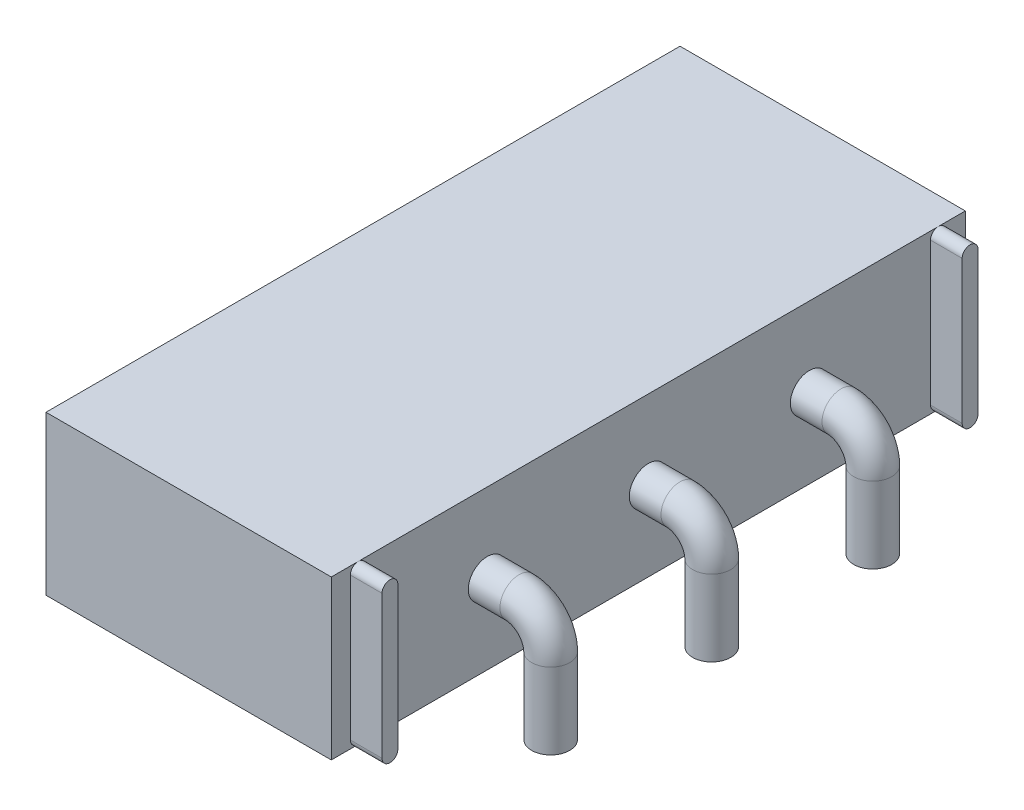
ISO-10303-21;
HEADER;
FILE_DESCRIPTION(('STEP AP214'),'2;1');
FILE_NAME('part.step','',(''),(''),'','','');
FILE_SCHEMA(('AUTOMOTIVE_DESIGN { 1 0 10303 214 1 1 1 1 }'));
ENDSEC;
DATA;
#1=APPLICATION_CONTEXT('core data for automotive mechanical design processes');
#2=APPLICATION_PROTOCOL_DEFINITION('international standard','automotive_design',2000,#1);
#3=PRODUCT_CONTEXT('',#1,'mechanical');
#4=PRODUCT('Part','Part','',(#3));
#5=PRODUCT_RELATED_PRODUCT_CATEGORY('part','',(#4));
#6=PRODUCT_DEFINITION_FORMATION('','',#4);
#7=PRODUCT_DEFINITION_CONTEXT('part definition',#1,'design');
#8=PRODUCT_DEFINITION('design','',#6,#7);
#9=PRODUCT_DEFINITION_SHAPE('','',#8);
#10=(LENGTH_UNIT() NAMED_UNIT(*) SI_UNIT(.MILLI.,.METRE.));
#11=(NAMED_UNIT(*) PLANE_ANGLE_UNIT() SI_UNIT($,.RADIAN.));
#12=(NAMED_UNIT(*) SI_UNIT($,.STERADIAN.) SOLID_ANGLE_UNIT());
#13=UNCERTAINTY_MEASURE_WITH_UNIT(LENGTH_MEASURE(1.E-05),#10,'distance_accuracy_value','');
#14=(GEOMETRIC_REPRESENTATION_CONTEXT(3) GLOBAL_UNCERTAINTY_ASSIGNED_CONTEXT((#13)) GLOBAL_UNIT_ASSIGNED_CONTEXT((#10,
#11,#12)) REPRESENTATION_CONTEXT('',''));
#15=CARTESIAN_POINT('',(0.,0.,0.));
#16=DIRECTION('',(0.,0.,1.));
#17=DIRECTION('',(1.,0.,0.));
#18=AXIS2_PLACEMENT_3D('',#15,#16,#17);
#19=CARTESIAN_POINT('',(4.5,2.5,0.));
#20=DIRECTION('',(-1.,0.,0.));
#21=DIRECTION('',(0.,0.,1.));
#22=AXIS2_PLACEMENT_3D('',#19,#20,#21);
#23=PLANE('',#22);
#24=CARTESIAN_POINT('',(4.5,1.25,-5.));
#25=DIRECTION('',(1.,0.,0.));
#26=DIRECTION('',(0.,0.,-1.));
#27=AXIS2_PLACEMENT_3D('',#24,#25,#26);
#28=CIRCLE('',#27,0.3);
#29=CARTESIAN_POINT('',(4.5,1.25,-5.3));
#30=VERTEX_POINT('',#29);
#31=EDGE_CURVE('E43',#30,#30,#28,.T.);
#32=ORIENTED_EDGE('',*,*,#31,.F.);
#33=EDGE_LOOP('',(#32));
#34=FACE_BOUND('',#33,.T.);
#35=CARTESIAN_POINT('',(4.5,0.125013060491364,-9.575));
#36=DIRECTION('',(1.,0.,0.));
#37=DIRECTION('',(0.,0.,-1.));
#38=AXIS2_PLACEMENT_3D('',#35,#36,#37);
#39=CIRCLE('',#38,0.125013060491364);
#40=CARTESIAN_POINT('',(4.5,0.123206048201041,-9.45));
#41=VERTEX_POINT('',#40);
#42=CARTESIAN_POINT('',(4.5,0.,-9.575));
#43=VERTEX_POINT('',#42);
#44=EDGE_CURVE('E277',#41,#43,#39,.T.);
#45=ORIENTED_EDGE('',*,*,#44,.F.);
#46=DIRECTION('',(0.,-1.,0.));
#47=VECTOR('',#46,1.);
#48=CARTESIAN_POINT('',(4.5,2.37679395179896,-9.45));
#49=LINE('',#48,#47);
#50=CARTESIAN_POINT('',(4.5,2.37679395179896,-9.45));
#51=VERTEX_POINT('',#50);
#52=EDGE_CURVE('E155',#51,#41,#49,.T.);
#53=ORIENTED_EDGE('',*,*,#52,.F.);
#54=CARTESIAN_POINT('',(4.5,2.37498693950864,-9.575));
#55=DIRECTION('',(1.,0.,0.));
#56=DIRECTION('',(0.,0.,-1.));
#57=AXIS2_PLACEMENT_3D('',#54,#55,#56);
#58=CIRCLE('',#57,0.125013060491363);
#59=CARTESIAN_POINT('',(4.5,2.5,-9.575));
#60=VERTEX_POINT('',#59);
#61=EDGE_CURVE('E280',#60,#51,#58,.T.);
#62=ORIENTED_EDGE('',*,*,#61,.F.);
#63=DIRECTION('',(0.,0.,-1.));
#64=VECTOR('',#63,1.);
#65=CARTESIAN_POINT('',(4.5,2.5,0.));
#66=LINE('',#65,#64);
#67=CARTESIAN_POINT('',(4.5,2.5,-0.425));
#68=VERTEX_POINT('',#67);
#69=EDGE_CURVE('E222',#68,#60,#66,.T.);
#70=ORIENTED_EDGE('',*,*,#69,.F.);
#71=CARTESIAN_POINT('',(4.5,2.37498693950864,-0.425));
#72=DIRECTION('',(1.,0.,0.));
#73=DIRECTION('',(0.,0.,1.));
#74=AXIS2_PLACEMENT_3D('',#71,#72,#73);
#75=CIRCLE('',#74,0.125013060491364);
#76=CARTESIAN_POINT('',(4.5,2.37679395179896,-0.55));
#77=VERTEX_POINT('',#76);
#78=EDGE_CURVE('E183',#77,#68,#75,.T.);
#79=ORIENTED_EDGE('',*,*,#78,.F.);
#80=DIRECTION('',(0.,1.,0.));
#81=VECTOR('',#80,1.);
#82=CARTESIAN_POINT('',(4.5,2.37679395179896,-0.55));
#83=LINE('',#82,#81);
#84=CARTESIAN_POINT('',(4.5,0.123206048201041,-0.55));
#85=VERTEX_POINT('',#84);
#86=EDGE_CURVE('E163',#85,#77,#83,.T.);
#87=ORIENTED_EDGE('',*,*,#86,.F.);
#88=CARTESIAN_POINT('',(4.5,0.125013060491364,-0.425));
#89=DIRECTION('',(1.,0.,0.));
#90=DIRECTION('',(0.,0.,1.));
#91=AXIS2_PLACEMENT_3D('',#88,#89,#90);
#92=CIRCLE('',#91,0.125013060491364);
#93=CARTESIAN_POINT('',(4.5,0.,-0.425));
#94=VERTEX_POINT('',#93);
#95=EDGE_CURVE('E165',#94,#85,#92,.T.);
#96=ORIENTED_EDGE('',*,*,#95,.F.);
#97=DIRECTION('',(0.,0.,-1.));
#98=VECTOR('',#97,1.);
#99=CARTESIAN_POINT('',(4.5,0.,0.));
#100=LINE('',#99,#98);
#101=EDGE_CURVE('E236',#94,#43,#100,.T.);
#102=ORIENTED_EDGE('',*,*,#101,.T.);
#103=EDGE_LOOP('',(#45,#53,#62,#70,#79,#87,#96,#102));
#104=FACE_BOUND('',#103,.T.);
#105=CARTESIAN_POINT('',(4.5,1.25,-7.54));
#106=DIRECTION('',(1.,0.,0.));
#107=DIRECTION('',(0.,0.,-1.));
#108=AXIS2_PLACEMENT_3D('',#105,#106,#107);
#109=CIRCLE('',#108,0.3);
#110=CARTESIAN_POINT('',(4.5,1.25,-7.84));
#111=VERTEX_POINT('',#110);
#112=EDGE_CURVE('E255',#111,#111,#109,.T.);
#113=ORIENTED_EDGE('',*,*,#112,.F.);
#114=EDGE_LOOP('',(#113));
#115=FACE_BOUND('',#114,.T.);
#116=CARTESIAN_POINT('',(4.5,1.25,-2.46));
#117=DIRECTION('',(1.,0.,0.));
#118=DIRECTION('',(0.,0.,-1.));
#119=AXIS2_PLACEMENT_3D('',#116,#117,#118);
#120=CIRCLE('',#119,0.3);
#121=CARTESIAN_POINT('',(4.5,1.25,-2.76));
#122=VERTEX_POINT('',#121);
#123=EDGE_CURVE('E11',#122,#122,#120,.T.);
#124=ORIENTED_EDGE('',*,*,#123,.F.);
#125=EDGE_LOOP('',(#124));
#126=FACE_BOUND('',#125,.T.);
#127=ADVANCED_FACE('F34',(#34,#104,#115,#126),#23,.F.);
#128=CARTESIAN_POINT('',(4.5,0.123206048201041,-9.7));
#129=VERTEX_POINT('',#128);
#130=EDGE_CURVE('E159',#43,#129,#39,.T.);
#131=ORIENTED_EDGE('',*,*,#130,.F.);
#132=CARTESIAN_POINT('',(4.5,0.,-10.));
#133=VERTEX_POINT('',#132);
#134=EDGE_CURVE('E231',#43,#133,#100,.T.);
#135=ORIENTED_EDGE('',*,*,#134,.T.);
#136=DIRECTION('',(0.,-1.,0.));
#137=VECTOR('',#136,1.);
#138=CARTESIAN_POINT('',(4.5,2.5,-10.));
#139=LINE('',#138,#137);
#140=CARTESIAN_POINT('',(4.5,2.5,-10.));
#141=VERTEX_POINT('',#140);
#142=EDGE_CURVE('E243',#141,#133,#139,.T.);
#143=ORIENTED_EDGE('',*,*,#142,.F.);
#144=EDGE_CURVE('E216',#60,#141,#66,.T.);
#145=ORIENTED_EDGE('',*,*,#144,.F.);
#146=CARTESIAN_POINT('',(4.5,2.37679395179896,-9.7));
#147=VERTEX_POINT('',#146);
#148=EDGE_CURVE('E56',#147,#60,#58,.T.);
#149=ORIENTED_EDGE('',*,*,#148,.F.);
#150=DIRECTION('',(0.,1.,0.));
#151=VECTOR('',#150,1.);
#152=CARTESIAN_POINT('',(4.5,0.123206048201041,-9.7));
#153=LINE('',#152,#151);
#154=EDGE_CURVE('E51',#129,#147,#153,.T.);
#155=ORIENTED_EDGE('',*,*,#154,.F.);
#156=EDGE_LOOP('',(#131,#135,#143,#145,#149,#155));
#157=FACE_BOUND('',#156,.T.);
#158=ADVANCED_FACE('F295',(#157),#23,.F.);
#159=DIRECTION('',(0.,-1.,0.));
#160=VECTOR('',#159,1.);
#161=CARTESIAN_POINT('',(4.5,0.123206048201041,-0.3));
#162=LINE('',#161,#160);
#163=CARTESIAN_POINT('',(4.5,2.37679395179896,-0.3));
#164=VERTEX_POINT('',#163);
#165=CARTESIAN_POINT('',(4.5,0.123206048201041,-0.3));
#166=VERTEX_POINT('',#165);
#167=EDGE_CURVE('E174',#164,#166,#162,.T.);
#168=ORIENTED_EDGE('',*,*,#167,.F.);
#169=EDGE_CURVE('E186',#68,#164,#75,.T.);
#170=ORIENTED_EDGE('',*,*,#169,.F.);
#171=CARTESIAN_POINT('',(4.5,2.5,0.));
#172=VERTEX_POINT('',#171);
#173=EDGE_CURVE('E218',#172,#68,#66,.T.);
#174=ORIENTED_EDGE('',*,*,#173,.F.);
#175=DIRECTION('',(0.,-1.,0.));
#176=VECTOR('',#175,1.);
#177=CARTESIAN_POINT('',(4.5,2.5,0.));
#178=LINE('',#177,#176);
#179=CARTESIAN_POINT('',(4.5,0.,0.));
#180=VERTEX_POINT('',#179);
#181=EDGE_CURVE('E38',#172,#180,#178,.T.);
#182=ORIENTED_EDGE('',*,*,#181,.T.);
#183=EDGE_CURVE('E232',#180,#94,#100,.T.);
#184=ORIENTED_EDGE('',*,*,#183,.T.);
#185=EDGE_CURVE('E160',#166,#94,#92,.T.);
#186=ORIENTED_EDGE('',*,*,#185,.F.);
#187=EDGE_LOOP('',(#168,#170,#174,#182,#184,#186));
#188=FACE_BOUND('',#187,.T.);
#189=ADVANCED_FACE('F314',(#188),#23,.F.);
#190=CARTESIAN_POINT('',(0.,2.5,0.));
#191=DIRECTION('',(0.,0.,-1.));
#192=DIRECTION('',(-1.,0.,0.));
#193=AXIS2_PLACEMENT_3D('',#190,#191,#192);
#194=PLANE('',#193);
#195=DIRECTION('',(1.,0.,0.));
#196=VECTOR('',#195,1.);
#197=CARTESIAN_POINT('',(0.,0.,0.));
#198=LINE('',#197,#196);
#199=CARTESIAN_POINT('',(0.,0.,0.));
#200=VERTEX_POINT('',#199);
#201=EDGE_CURVE('E210',#200,#180,#198,.T.);
#202=ORIENTED_EDGE('',*,*,#201,.T.);
#203=ORIENTED_EDGE('',*,*,#181,.F.);
#204=DIRECTION('',(1.,0.,0.));
#205=VECTOR('',#204,1.);
#206=CARTESIAN_POINT('',(0.,2.5,0.));
#207=LINE('',#206,#205);
#208=CARTESIAN_POINT('',(0.,2.5,0.));
#209=VERTEX_POINT('',#208);
#210=EDGE_CURVE('E213',#209,#172,#207,.T.);
#211=ORIENTED_EDGE('',*,*,#210,.F.);
#212=DIRECTION('',(0.,-1.,0.));
#213=VECTOR('',#212,1.);
#214=CARTESIAN_POINT('',(0.,2.5,0.));
#215=LINE('',#214,#213);
#216=EDGE_CURVE('E228',#209,#200,#215,.T.);
#217=ORIENTED_EDGE('',*,*,#216,.T.);
#218=EDGE_LOOP('',(#202,#203,#211,#217));
#219=FACE_BOUND('',#218,.T.);
#220=ADVANCED_FACE('F36',(#219),#194,.F.);
#221=CARTESIAN_POINT('',(0.,2.5,-10.));
#222=DIRECTION('',(0.,0.,-1.));
#223=DIRECTION('',(-1.,0.,0.));
#224=AXIS2_PLACEMENT_3D('',#221,#222,#223);
#225=PLANE('',#224);
#226=DIRECTION('',(1.,0.,0.));
#227=VECTOR('',#226,1.);
#228=CARTESIAN_POINT('',(0.,0.,-10.));
#229=LINE('',#228,#227);
#230=CARTESIAN_POINT('',(0.,0.,-10.));
#231=VERTEX_POINT('',#230);
#232=EDGE_CURVE('E235',#231,#133,#229,.T.);
#233=ORIENTED_EDGE('',*,*,#232,.F.);
#234=DIRECTION('',(0.,-1.,0.));
#235=VECTOR('',#234,1.);
#236=CARTESIAN_POINT('',(0.,2.5,-10.));
#237=LINE('',#236,#235);
#238=CARTESIAN_POINT('',(0.,2.5,-10.));
#239=VERTEX_POINT('',#238);
#240=EDGE_CURVE('E242',#239,#231,#237,.T.);
#241=ORIENTED_EDGE('',*,*,#240,.F.);
#242=DIRECTION('',(1.,0.,0.));
#243=VECTOR('',#242,1.);
#244=CARTESIAN_POINT('',(0.,2.5,-10.));
#245=LINE('',#244,#243);
#246=EDGE_CURVE('E221',#239,#141,#245,.T.);
#247=ORIENTED_EDGE('',*,*,#246,.T.);
#248=ORIENTED_EDGE('',*,*,#142,.T.);
#249=EDGE_LOOP('',(#233,#241,#247,#248));
#250=FACE_BOUND('',#249,.T.);
#251=ADVANCED_FACE('F322',(#250),#225,.T.);
#252=CARTESIAN_POINT('',(0.,2.5,0.));
#253=DIRECTION('',(-1.,0.,0.));
#254=DIRECTION('',(0.,0.,1.));
#255=AXIS2_PLACEMENT_3D('',#252,#253,#254);
#256=PLANE('',#255);
#257=CARTESIAN_POINT('',(0.,1.25,-0.65));
#258=DIRECTION('',(-1.,0.,0.));
#259=DIRECTION('',(0.,0.,-1.));
#260=AXIS2_PLACEMENT_3D('',#257,#258,#259);
#261=CIRCLE('',#260,0.500000000000001);
#262=CARTESIAN_POINT('',(0.,1.25,-1.15));
#263=VERTEX_POINT('',#262);
#264=EDGE_CURVE('E200',#263,#263,#261,.T.);
#265=ORIENTED_EDGE('',*,*,#264,.F.);
#266=EDGE_LOOP('',(#265));
#267=FACE_BOUND('',#266,.T.);
#268=CARTESIAN_POINT('',(0.,1.25,-9.35));
#269=DIRECTION('',(-1.,0.,0.));
#270=DIRECTION('',(0.,0.,1.));
#271=AXIS2_PLACEMENT_3D('',#268,#269,#270);
#272=CIRCLE('',#271,0.500000000000001);
#273=CARTESIAN_POINT('',(0.,1.25,-8.85));
#274=VERTEX_POINT('',#273);
#275=EDGE_CURVE('E204',#274,#274,#272,.T.);
#276=ORIENTED_EDGE('',*,*,#275,.F.);
#277=EDGE_LOOP('',(#276));
#278=FACE_BOUND('',#277,.T.);
#279=DIRECTION('',(0.,0.,-1.));
#280=VECTOR('',#279,1.);
#281=CARTESIAN_POINT('',(0.,0.,0.));
#282=LINE('',#281,#280);
#283=EDGE_CURVE('E217',#200,#231,#282,.T.);
#284=ORIENTED_EDGE('',*,*,#283,.F.);
#285=ORIENTED_EDGE('',*,*,#216,.F.);
#286=DIRECTION('',(0.,0.,-1.));
#287=VECTOR('',#286,1.);
#288=CARTESIAN_POINT('',(0.,2.5,0.));
#289=LINE('',#288,#287);
#290=EDGE_CURVE('E225',#209,#239,#289,.T.);
#291=ORIENTED_EDGE('',*,*,#290,.T.);
#292=ORIENTED_EDGE('',*,*,#240,.T.);
#293=EDGE_LOOP('',(#284,#285,#291,#292));
#294=FACE_BOUND('',#293,.T.);
#295=ADVANCED_FACE('F324',(#267,#278,#294),#256,.T.);
#296=CARTESIAN_POINT('',(0.,2.5,0.));
#297=DIRECTION('',(0.,1.,0.));
#298=DIRECTION('',(0.,0.,1.));
#299=AXIS2_PLACEMENT_3D('',#296,#297,#298);
#300=PLANE('',#299);
#301=ORIENTED_EDGE('',*,*,#210,.T.);
#302=ORIENTED_EDGE('',*,*,#173,.T.);
#303=ORIENTED_EDGE('',*,*,#69,.T.);
#304=ORIENTED_EDGE('',*,*,#144,.T.);
#305=ORIENTED_EDGE('',*,*,#246,.F.);
#306=ORIENTED_EDGE('',*,*,#290,.F.);
#307=EDGE_LOOP('',(#301,#302,#303,#304,#305,#306));
#308=FACE_BOUND('',#307,.T.);
#309=ADVANCED_FACE('F298',(#308),#300,.T.);
#310=CARTESIAN_POINT('',(0.,0.,0.));
#311=DIRECTION('',(0.,1.,0.));
#312=DIRECTION('',(0.,0.,1.));
#313=AXIS2_PLACEMENT_3D('',#310,#311,#312);
#314=PLANE('',#313);
#315=ORIENTED_EDGE('',*,*,#201,.F.);
#316=ORIENTED_EDGE('',*,*,#283,.T.);
#317=ORIENTED_EDGE('',*,*,#232,.T.);
#318=ORIENTED_EDGE('',*,*,#134,.F.);
#319=ORIENTED_EDGE('',*,*,#101,.F.);
#320=ORIENTED_EDGE('',*,*,#183,.F.);
#321=EDGE_LOOP('',(#315,#316,#317,#318,#319,#320));
#322=FACE_BOUND('',#321,.T.);
#323=ADVANCED_FACE('F318',(#322),#314,.F.);
#324=CARTESIAN_POINT('',(1.,1.25,-9.35));
#325=DIRECTION('',(-1.,0.,0.));
#326=DIRECTION('',(0.,0.,1.));
#327=AXIS2_PLACEMENT_3D('',#324,#325,#326);
#328=CYLINDRICAL_SURFACE('',#327,0.500000000000001);
#329=CARTESIAN_POINT('',(1.,1.25,-9.35));
#330=DIRECTION('',(-1.,0.,0.));
#331=DIRECTION('',(0.,0.,1.));
#332=AXIS2_PLACEMENT_3D('',#329,#330,#331);
#333=CIRCLE('',#332,0.500000000000001);
#334=CARTESIAN_POINT('',(1.,1.25,-8.85));
#335=VERTEX_POINT('',#334);
#336=EDGE_CURVE('E207',#335,#335,#333,.T.);
#337=ORIENTED_EDGE('',*,*,#336,.F.);
#338=EDGE_LOOP('',(#337));
#339=FACE_BOUND('',#338,.T.);
#340=ORIENTED_EDGE('',*,*,#275,.T.);
#341=EDGE_LOOP('',(#340));
#342=FACE_BOUND('',#341,.T.);
#343=ADVANCED_FACE('F346',(#339,#342),#328,.F.);
#344=CARTESIAN_POINT('',(1.,1.25,-9.35));
#345=DIRECTION('',(-1.,0.,0.));
#346=DIRECTION('',(0.,0.,1.));
#347=AXIS2_PLACEMENT_3D('',#344,#345,#346);
#348=PLANE('',#347);
#349=ORIENTED_EDGE('',*,*,#336,.T.);
#350=EDGE_LOOP('',(#349));
#351=FACE_BOUND('',#350,.T.);
#352=ADVANCED_FACE('F351',(#351),#348,.T.);
#353=CARTESIAN_POINT('',(0.1,1.25,-0.65));
#354=DIRECTION('',(-1.,0.,0.));
#355=DIRECTION('',(0.,0.,1.));
#356=AXIS2_PLACEMENT_3D('',#353,#354,#355);
#357=CYLINDRICAL_SURFACE('',#356,0.500000000000001);
#358=CARTESIAN_POINT('',(0.1,1.25,-0.65));
#359=DIRECTION('',(-1.,0.,0.));
#360=DIRECTION('',(0.,0.,-1.));
#361=AXIS2_PLACEMENT_3D('',#358,#359,#360);
#362=CIRCLE('',#361,0.500000000000001);
#363=CARTESIAN_POINT('',(0.1,1.25,-1.15));
#364=VERTEX_POINT('',#363);
#365=EDGE_CURVE('E201',#364,#364,#362,.T.);
#366=ORIENTED_EDGE('',*,*,#365,.F.);
#367=EDGE_LOOP('',(#366));
#368=FACE_BOUND('',#367,.T.);
#369=ORIENTED_EDGE('',*,*,#264,.T.);
#370=EDGE_LOOP('',(#369));
#371=FACE_BOUND('',#370,.T.);
#372=ADVANCED_FACE('F355',(#368,#371),#357,.F.);
#373=CARTESIAN_POINT('',(0.1,1.25,-0.65));
#374=DIRECTION('',(1.,0.,0.));
#375=DIRECTION('',(0.,0.,-1.));
#376=AXIS2_PLACEMENT_3D('',#373,#374,#375);
#377=PLANE('',#376);
#378=ORIENTED_EDGE('',*,*,#365,.T.);
#379=EDGE_LOOP('',(#378));
#380=FACE_BOUND('',#379,.T.);
#381=ADVANCED_FACE('F359',(#380),#377,.F.);
#382=CARTESIAN_POINT('',(5.,0.125013060491364,-0.425));
#383=DIRECTION('',(-1.,0.,0.));
#384=DIRECTION('',(0.,0.,1.));
#385=AXIS2_PLACEMENT_3D('',#382,#383,#384);
#386=CYLINDRICAL_SURFACE('',#385,0.125013060491364);
#387=ORIENTED_EDGE('',*,*,#185,.T.);
#388=ORIENTED_EDGE('',*,*,#95,.T.);
#389=DIRECTION('',(-1.,0.,0.));
#390=VECTOR('',#389,1.);
#391=CARTESIAN_POINT('',(5.,0.123206048201041,-0.55));
#392=LINE('',#391,#390);
#393=CARTESIAN_POINT('',(5.,0.123206048201041,-0.55));
#394=VERTEX_POINT('',#393);
#395=EDGE_CURVE('E197',#394,#85,#392,.T.);
#396=ORIENTED_EDGE('',*,*,#395,.F.);
#397=CARTESIAN_POINT('',(5.,0.125013060491364,-0.425));
#398=DIRECTION('',(1.,0.,0.));
#399=DIRECTION('',(0.,0.,1.));
#400=AXIS2_PLACEMENT_3D('',#397,#398,#399);
#401=CIRCLE('',#400,0.125013060491364);
#402=CARTESIAN_POINT('',(5.,0.123206048201041,-0.3));
#403=VERTEX_POINT('',#402);
#404=EDGE_CURVE('E170',#403,#394,#401,.T.);
#405=ORIENTED_EDGE('',*,*,#404,.F.);
#406=DIRECTION('',(-1.,0.,0.));
#407=VECTOR('',#406,1.);
#408=CARTESIAN_POINT('',(5.,0.123206048201041,-0.3));
#409=LINE('',#408,#407);
#410=EDGE_CURVE('E179',#403,#166,#409,.T.);
#411=ORIENTED_EDGE('',*,*,#410,.T.);
#412=EDGE_LOOP('',(#387,#388,#396,#405,#411));
#413=FACE_BOUND('',#412,.T.);
#414=ADVANCED_FACE('F307',(#413),#386,.T.);
#415=CARTESIAN_POINT('',(5.,2.37679395179896,-0.55));
#416=DIRECTION('',(0.,0.,1.));
#417=DIRECTION('',(0.,-1.,0.));
#418=AXIS2_PLACEMENT_3D('',#415,#416,#417);
#419=PLANE('',#418);
#420=ORIENTED_EDGE('',*,*,#86,.T.);
#421=DIRECTION('',(-1.,0.,0.));
#422=VECTOR('',#421,1.);
#423=CARTESIAN_POINT('',(5.,2.37679395179896,-0.55));
#424=LINE('',#423,#422);
#425=CARTESIAN_POINT('',(5.,2.37679395179896,-0.55));
#426=VERTEX_POINT('',#425);
#427=EDGE_CURVE('E194',#426,#77,#424,.T.);
#428=ORIENTED_EDGE('',*,*,#427,.F.);
#429=DIRECTION('',(0.,1.,0.));
#430=VECTOR('',#429,1.);
#431=CARTESIAN_POINT('',(5.,2.37679395179896,-0.55));
#432=LINE('',#431,#430);
#433=EDGE_CURVE('E173',#394,#426,#432,.T.);
#434=ORIENTED_EDGE('',*,*,#433,.F.);
#435=ORIENTED_EDGE('',*,*,#395,.T.);
#436=EDGE_LOOP('',(#420,#428,#434,#435));
#437=FACE_BOUND('',#436,.T.);
#438=ADVANCED_FACE('F305',(#437),#419,.F.);
#439=CARTESIAN_POINT('',(5.,2.37498693950864,-0.425));
#440=DIRECTION('',(-1.,0.,0.));
#441=DIRECTION('',(0.,0.,1.));
#442=AXIS2_PLACEMENT_3D('',#439,#440,#441);
#443=CYLINDRICAL_SURFACE('',#442,0.125013060491364);
#444=ORIENTED_EDGE('',*,*,#78,.T.);
#445=ORIENTED_EDGE('',*,*,#169,.T.);
#446=DIRECTION('',(-1.,0.,0.));
#447=VECTOR('',#446,1.);
#448=CARTESIAN_POINT('',(5.,2.37679395179896,-0.3));
#449=LINE('',#448,#447);
#450=CARTESIAN_POINT('',(5.,2.37679395179896,-0.3));
#451=VERTEX_POINT('',#450);
#452=EDGE_CURVE('E191',#451,#164,#449,.T.);
#453=ORIENTED_EDGE('',*,*,#452,.F.);
#454=CARTESIAN_POINT('',(5.,2.37498693950864,-0.425));
#455=DIRECTION('',(1.,0.,0.));
#456=DIRECTION('',(0.,0.,1.));
#457=AXIS2_PLACEMENT_3D('',#454,#455,#456);
#458=CIRCLE('',#457,0.125013060491364);
#459=EDGE_CURVE('E176',#426,#451,#458,.T.);
#460=ORIENTED_EDGE('',*,*,#459,.F.);
#461=ORIENTED_EDGE('',*,*,#427,.T.);
#462=EDGE_LOOP('',(#444,#445,#453,#460,#461));
#463=FACE_BOUND('',#462,.T.);
#464=ADVANCED_FACE('F301',(#463),#443,.T.);
#465=CARTESIAN_POINT('',(5.,0.123206048201041,-0.3));
#466=DIRECTION('',(0.,0.,-1.));
#467=DIRECTION('',(0.,1.,0.));
#468=AXIS2_PLACEMENT_3D('',#465,#466,#467);
#469=PLANE('',#468);
#470=ORIENTED_EDGE('',*,*,#167,.T.);
#471=ORIENTED_EDGE('',*,*,#410,.F.);
#472=DIRECTION('',(0.,-1.,0.));
#473=VECTOR('',#472,1.);
#474=CARTESIAN_POINT('',(5.,0.123206048201041,-0.3));
#475=LINE('',#474,#473);
#476=EDGE_CURVE('E178',#451,#403,#475,.T.);
#477=ORIENTED_EDGE('',*,*,#476,.F.);
#478=ORIENTED_EDGE('',*,*,#452,.T.);
#479=EDGE_LOOP('',(#470,#471,#477,#478));
#480=FACE_BOUND('',#479,.T.);
#481=ADVANCED_FACE('F313',(#480),#469,.F.);
#482=CARTESIAN_POINT('',(5.,0.125013060491364,-0.425));
#483=DIRECTION('',(-1.,0.,0.));
#484=DIRECTION('',(0.,0.,1.));
#485=AXIS2_PLACEMENT_3D('',#482,#483,#484);
#486=PLANE('',#485);
#487=ORIENTED_EDGE('',*,*,#404,.T.);
#488=ORIENTED_EDGE('',*,*,#433,.T.);
#489=ORIENTED_EDGE('',*,*,#459,.T.);
#490=ORIENTED_EDGE('',*,*,#476,.T.);
#491=EDGE_LOOP('',(#487,#488,#489,#490));
#492=FACE_BOUND('',#491,.T.);
#493=ADVANCED_FACE('F310',(#492),#486,.F.);
#494=CARTESIAN_POINT('',(5.,0.125013060491364,-9.575));
#495=DIRECTION('',(-1.,0.,0.));
#496=DIRECTION('',(0.,0.,1.));
#497=AXIS2_PLACEMENT_3D('',#494,#495,#496);
#498=CYLINDRICAL_SURFACE('',#497,0.125013060491364);
#499=ORIENTED_EDGE('',*,*,#44,.T.);
#500=ORIENTED_EDGE('',*,*,#130,.T.);
#501=DIRECTION('',(-1.,0.,0.));
#502=VECTOR('',#501,1.);
#503=CARTESIAN_POINT('',(5.,0.123206048201041,-9.7));
#504=LINE('',#503,#502);
#505=CARTESIAN_POINT('',(5.,0.123206048201041,-9.7));
#506=VERTEX_POINT('',#505);
#507=EDGE_CURVE('E140',#506,#129,#504,.T.);
#508=ORIENTED_EDGE('',*,*,#507,.F.);
#509=CARTESIAN_POINT('',(5.,0.125013060491364,-9.575));
#510=DIRECTION('',(1.,0.,0.));
#511=DIRECTION('',(0.,0.,-1.));
#512=AXIS2_PLACEMENT_3D('',#509,#510,#511);
#513=CIRCLE('',#512,0.125013060491364);
#514=CARTESIAN_POINT('',(5.,0.123206048201041,-9.45));
#515=VERTEX_POINT('',#514);
#516=EDGE_CURVE('E146',#515,#506,#513,.T.);
#517=ORIENTED_EDGE('',*,*,#516,.F.);
#518=DIRECTION('',(-1.,0.,0.));
#519=VECTOR('',#518,1.);
#520=CARTESIAN_POINT('',(5.,0.123206048201041,-9.45));
#521=LINE('',#520,#519);
#522=EDGE_CURVE('E276',#515,#41,#521,.T.);
#523=ORIENTED_EDGE('',*,*,#522,.T.);
#524=EDGE_LOOP('',(#499,#500,#508,#517,#523));
#525=FACE_BOUND('',#524,.T.);
#526=ADVANCED_FACE('F158',(#525),#498,.T.);
#527=CARTESIAN_POINT('',(5.,0.123206048201041,-9.7));
#528=DIRECTION('',(0.,0.,1.));
#529=DIRECTION('',(1.,0.,0.));
#530=AXIS2_PLACEMENT_3D('',#527,#528,#529);
#531=PLANE('',#530);
#532=ORIENTED_EDGE('',*,*,#154,.T.);
#533=DIRECTION('',(-1.,0.,0.));
#534=VECTOR('',#533,1.);
#535=CARTESIAN_POINT('',(5.,2.37679395179896,-9.7));
#536=LINE('',#535,#534);
#537=CARTESIAN_POINT('',(5.,2.37679395179896,-9.7));
#538=VERTEX_POINT('',#537);
#539=EDGE_CURVE('E142',#538,#147,#536,.T.);
#540=ORIENTED_EDGE('',*,*,#539,.F.);
#541=DIRECTION('',(0.,1.,0.));
#542=VECTOR('',#541,1.);
#543=CARTESIAN_POINT('',(5.,0.123206048201041,-9.7));
#544=LINE('',#543,#542);
#545=EDGE_CURVE('E136',#506,#538,#544,.T.);
#546=ORIENTED_EDGE('',*,*,#545,.F.);
#547=ORIENTED_EDGE('',*,*,#507,.T.);
#548=EDGE_LOOP('',(#532,#540,#546,#547));
#549=FACE_BOUND('',#548,.T.);
#550=ADVANCED_FACE('F138',(#549),#531,.F.);
#551=CARTESIAN_POINT('',(5.,2.37498693950864,-9.575));
#552=DIRECTION('',(-1.,0.,0.));
#553=DIRECTION('',(0.,0.,1.));
#554=AXIS2_PLACEMENT_3D('',#551,#552,#553);
#555=CYLINDRICAL_SURFACE('',#554,0.125013060491363);
#556=ORIENTED_EDGE('',*,*,#148,.T.);
#557=ORIENTED_EDGE('',*,*,#61,.T.);
#558=DIRECTION('',(-1.,0.,0.));
#559=VECTOR('',#558,1.);
#560=CARTESIAN_POINT('',(5.,2.37679395179896,-9.45));
#561=LINE('',#560,#559);
#562=CARTESIAN_POINT('',(5.,2.37679395179896,-9.45));
#563=VERTEX_POINT('',#562);
#564=EDGE_CURVE('E166',#563,#51,#561,.T.);
#565=ORIENTED_EDGE('',*,*,#564,.F.);
#566=CARTESIAN_POINT('',(5.,2.37498693950864,-9.575));
#567=DIRECTION('',(1.,0.,0.));
#568=DIRECTION('',(0.,0.,-1.));
#569=AXIS2_PLACEMENT_3D('',#566,#567,#568);
#570=CIRCLE('',#569,0.125013060491363);
#571=EDGE_CURVE('E145',#538,#563,#570,.T.);
#572=ORIENTED_EDGE('',*,*,#571,.F.);
#573=ORIENTED_EDGE('',*,*,#539,.T.);
#574=EDGE_LOOP('',(#556,#557,#565,#572,#573));
#575=FACE_BOUND('',#574,.T.);
#576=ADVANCED_FACE('F290',(#575),#555,.T.);
#577=CARTESIAN_POINT('',(5.,2.37679395179896,-9.45));
#578=DIRECTION('',(0.,0.,-1.));
#579=DIRECTION('',(0.,1.,0.));
#580=AXIS2_PLACEMENT_3D('',#577,#578,#579);
#581=PLANE('',#580);
#582=ORIENTED_EDGE('',*,*,#52,.T.);
#583=ORIENTED_EDGE('',*,*,#522,.F.);
#584=DIRECTION('',(0.,-1.,0.));
#585=VECTOR('',#584,1.);
#586=CARTESIAN_POINT('',(5.,2.37679395179896,-9.45));
#587=LINE('',#586,#585);
#588=EDGE_CURVE('E151',#563,#515,#587,.T.);
#589=ORIENTED_EDGE('',*,*,#588,.F.);
#590=ORIENTED_EDGE('',*,*,#564,.T.);
#591=EDGE_LOOP('',(#582,#583,#589,#590));
#592=FACE_BOUND('',#591,.T.);
#593=ADVANCED_FACE('F287',(#592),#581,.F.);
#594=CARTESIAN_POINT('',(5.,0.125013060491364,-9.575));
#595=DIRECTION('',(1.,0.,0.));
#596=DIRECTION('',(0.,0.,-1.));
#597=AXIS2_PLACEMENT_3D('',#594,#595,#596);
#598=PLANE('',#597);
#599=ORIENTED_EDGE('',*,*,#516,.T.);
#600=ORIENTED_EDGE('',*,*,#545,.T.);
#601=ORIENTED_EDGE('',*,*,#571,.T.);
#602=ORIENTED_EDGE('',*,*,#588,.T.);
#603=EDGE_LOOP('',(#599,#600,#601,#602));
#604=FACE_BOUND('',#603,.T.);
#605=ADVANCED_FACE('F149',(#604),#598,.T.);
#606=CARTESIAN_POINT('',(5.5,0.749999999999999,-7.54));
#607=DIRECTION('',(0.,-1.,0.));
#608=DIRECTION('',(1.,0.,0.));
#609=AXIS2_PLACEMENT_3D('',#606,#607,#608);
#610=CYLINDRICAL_SURFACE('',#609,0.3);
#611=CARTESIAN_POINT('',(5.5,0.749999999999999,-7.54));
#612=DIRECTION('',(0.,-1.,0.));
#613=DIRECTION('',(0.,0.,-1.));
#614=AXIS2_PLACEMENT_3D('',#611,#612,#613);
#615=CIRCLE('',#614,0.3);
#616=CARTESIAN_POINT('',(5.8,0.749999999999998,-7.54));
#617=VERTEX_POINT('',#616);
#618=EDGE_CURVE('E268',#617,#617,#615,.T.);
#619=ORIENTED_EDGE('',*,*,#618,.T.);
#620=EDGE_LOOP('',(#619));
#621=FACE_BOUND('',#620,.T.);
#622=CARTESIAN_POINT('',(5.5,-0.450000000000001,-7.54));
#623=DIRECTION('',(0.,-1.,0.));
#624=DIRECTION('',(0.,0.,-1.));
#625=AXIS2_PLACEMENT_3D('',#622,#623,#624);
#626=CIRCLE('',#625,0.3);
#627=CARTESIAN_POINT('',(5.5,-0.450000000000001,-7.84));
#628=VERTEX_POINT('',#627);
#629=EDGE_CURVE('E271',#628,#628,#626,.T.);
#630=ORIENTED_EDGE('',*,*,#629,.F.);
#631=EDGE_LOOP('',(#630));
#632=FACE_BOUND('',#631,.T.);
#633=ADVANCED_FACE('F384',(#621,#632),#610,.T.);
#634=CARTESIAN_POINT('',(5.,0.75,-7.54));
#635=DIRECTION('',(0.,0.,-1.));
#636=DIRECTION('',(-1.,0.,0.));
#637=AXIS2_PLACEMENT_3D('',#634,#635,#636);
#638=TOROIDAL_SURFACE('',#637,0.5,0.3);
#639=CARTESIAN_POINT('',(5.,1.25,-7.54));
#640=DIRECTION('',(1.,0.,0.));
#641=DIRECTION('',(0.,0.,-1.));
#642=AXIS2_PLACEMENT_3D('',#639,#640,#641);
#643=CIRCLE('',#642,0.3);
#644=CARTESIAN_POINT('',(5.,1.55,-7.54));
#645=VERTEX_POINT('',#644);
#646=EDGE_CURVE('E266',#645,#645,#643,.T.);
#647=CARTESIAN_POINT('',(5.,0.75,-7.54));
#648=DIRECTION('',(0.,0.,-1.));
#649=DIRECTION('',(-1.,0.,0.));
#650=AXIS2_PLACEMENT_3D('',#647,#648,#649);
#651=CIRCLE('',#650,0.8);
#652=EDGE_CURVE('',#645,#617,#651,.T.);
#653=ORIENTED_EDGE('',*,*,#646,.T.);
#654=ORIENTED_EDGE('',*,*,#618,.F.);
#655=ORIENTED_EDGE('',*,*,#652,.T.);
#656=ORIENTED_EDGE('',*,*,#652,.F.);
#657=EDGE_LOOP('',(#653,#655,#654,#656));
#658=FACE_BOUND('',#657,.T.);
#659=ADVANCED_FACE('F387',(#658),#638,.T.);
#660=CARTESIAN_POINT('',(5.,1.25,-7.54));
#661=DIRECTION('',(-1.,0.,0.));
#662=DIRECTION('',(0.,-1.,0.));
#663=AXIS2_PLACEMENT_3D('',#660,#661,#662);
#664=CYLINDRICAL_SURFACE('',#663,0.3);
#665=ORIENTED_EDGE('',*,*,#646,.F.);
#666=EDGE_LOOP('',(#665));
#667=FACE_BOUND('',#666,.T.);
#668=ORIENTED_EDGE('',*,*,#112,.T.);
#669=EDGE_LOOP('',(#668));
#670=FACE_BOUND('',#669,.T.);
#671=ADVANCED_FACE('F391',(#667,#670),#664,.T.);
#672=CARTESIAN_POINT('',(5.5,-0.450000000000001,-7.54));
#673=DIRECTION('',(0.,-1.,0.));
#674=DIRECTION('',(0.,0.,-1.));
#675=AXIS2_PLACEMENT_3D('',#672,#673,#674);
#676=PLANE('',#675);
#677=ORIENTED_EDGE('',*,*,#629,.T.);
#678=EDGE_LOOP('',(#677));
#679=FACE_BOUND('',#678,.T.);
#680=ADVANCED_FACE('F395',(#679),#676,.T.);
#681=CARTESIAN_POINT('',(5.5,0.749999999999999,-5.));
#682=DIRECTION('',(0.,-1.,0.));
#683=DIRECTION('',(1.,0.,0.));
#684=AXIS2_PLACEMENT_3D('',#681,#682,#683);
#685=CYLINDRICAL_SURFACE('',#684,0.3);
#686=CARTESIAN_POINT('',(5.5,0.749999999999999,-5.));
#687=DIRECTION('',(0.,-1.,0.));
#688=DIRECTION('',(0.,0.,-1.));
#689=AXIS2_PLACEMENT_3D('',#686,#687,#688);
#690=CIRCLE('',#689,0.3);
#691=CARTESIAN_POINT('',(5.8,0.749999999999998,-5.));
#692=VERTEX_POINT('',#691);
#693=EDGE_CURVE('E441',#692,#692,#690,.T.);
#694=ORIENTED_EDGE('',*,*,#693,.T.);
#695=EDGE_LOOP('',(#694));
#696=FACE_BOUND('',#695,.T.);
#697=CARTESIAN_POINT('',(5.5,-0.450000000000001,-5.));
#698=DIRECTION('',(0.,-1.,0.));
#699=DIRECTION('',(0.,0.,-1.));
#700=AXIS2_PLACEMENT_3D('',#697,#698,#699);
#701=CIRCLE('',#700,0.3);
#702=CARTESIAN_POINT('',(5.5,-0.450000000000001,-5.3));
#703=VERTEX_POINT('',#702);
#704=EDGE_CURVE('E448',#703,#703,#701,.T.);
#705=ORIENTED_EDGE('',*,*,#704,.F.);
#706=EDGE_LOOP('',(#705));
#707=FACE_BOUND('',#706,.T.);
#708=ADVANCED_FACE('F399',(#696,#707),#685,.T.);
#709=CARTESIAN_POINT('',(5.,0.75,-5.));
#710=DIRECTION('',(0.,0.,-1.));
#711=DIRECTION('',(-1.,0.,0.));
#712=AXIS2_PLACEMENT_3D('',#709,#710,#711);
#713=TOROIDAL_SURFACE('',#712,0.5,0.3);
#714=CARTESIAN_POINT('',(5.,1.25,-5.));
#715=DIRECTION('',(1.,0.,0.));
#716=DIRECTION('',(0.,0.,-1.));
#717=AXIS2_PLACEMENT_3D('',#714,#715,#716);
#718=CIRCLE('',#717,0.3);
#719=CARTESIAN_POINT('',(5.,1.55,-5.));
#720=VERTEX_POINT('',#719);
#721=EDGE_CURVE('E437',#720,#720,#718,.T.);
#722=CARTESIAN_POINT('',(5.,0.75,-5.));
#723=DIRECTION('',(0.,0.,-1.));
#724=DIRECTION('',(-1.,0.,0.));
#725=AXIS2_PLACEMENT_3D('',#722,#723,#724);
#726=CIRCLE('',#725,0.8);
#727=EDGE_CURVE('',#720,#692,#726,.T.);
#728=ORIENTED_EDGE('',*,*,#721,.T.);
#729=ORIENTED_EDGE('',*,*,#693,.F.);
#730=ORIENTED_EDGE('',*,*,#727,.T.);
#731=ORIENTED_EDGE('',*,*,#727,.F.);
#732=EDGE_LOOP('',(#728,#730,#729,#731));
#733=FACE_BOUND('',#732,.T.);
#734=ADVANCED_FACE('F403',(#733),#713,.T.);
#735=CARTESIAN_POINT('',(5.,1.25,-5.));
#736=DIRECTION('',(-1.,0.,0.));
#737=DIRECTION('',(0.,-1.,0.));
#738=AXIS2_PLACEMENT_3D('',#735,#736,#737);
#739=CYLINDRICAL_SURFACE('',#738,0.3);
#740=ORIENTED_EDGE('',*,*,#721,.F.);
#741=EDGE_LOOP('',(#740));
#742=FACE_BOUND('',#741,.T.);
#743=ORIENTED_EDGE('',*,*,#31,.T.);
#744=EDGE_LOOP('',(#743));
#745=FACE_BOUND('',#744,.T.);
#746=ADVANCED_FACE('F407',(#742,#745),#739,.T.);
#747=CARTESIAN_POINT('',(5.5,-0.450000000000001,-5.));
#748=DIRECTION('',(0.,-1.,0.));
#749=DIRECTION('',(0.,0.,-1.));
#750=AXIS2_PLACEMENT_3D('',#747,#748,#749);
#751=PLANE('',#750);
#752=ORIENTED_EDGE('',*,*,#704,.T.);
#753=EDGE_LOOP('',(#752));
#754=FACE_BOUND('',#753,.T.);
#755=ADVANCED_FACE('F411',(#754),#751,.T.);
#756=CARTESIAN_POINT('',(5.5,0.749999999999999,-2.46));
#757=DIRECTION('',(0.,-1.,0.));
#758=DIRECTION('',(1.,0.,0.));
#759=AXIS2_PLACEMENT_3D('',#756,#757,#758);
#760=CYLINDRICAL_SURFACE('',#759,0.3);
#761=CARTESIAN_POINT('',(5.5,0.749999999999999,-2.46));
#762=DIRECTION('',(0.,-1.,0.));
#763=DIRECTION('',(0.,0.,-1.));
#764=AXIS2_PLACEMENT_3D('',#761,#762,#763);
#765=CIRCLE('',#764,0.3);
#766=CARTESIAN_POINT('',(5.8,0.749999999999998,-2.46));
#767=VERTEX_POINT('',#766);
#768=EDGE_CURVE('E438',#767,#767,#765,.T.);
#769=ORIENTED_EDGE('',*,*,#768,.T.);
#770=EDGE_LOOP('',(#769));
#771=FACE_BOUND('',#770,.T.);
#772=CARTESIAN_POINT('',(5.5,-0.450000000000001,-2.46));
#773=DIRECTION('',(0.,-1.,0.));
#774=DIRECTION('',(0.,0.,-1.));
#775=AXIS2_PLACEMENT_3D('',#772,#773,#774);
#776=CIRCLE('',#775,0.3);
#777=CARTESIAN_POINT('',(5.5,-0.450000000000001,-2.76));
#778=VERTEX_POINT('',#777);
#779=EDGE_CURVE('E435',#778,#778,#776,.T.);
#780=ORIENTED_EDGE('',*,*,#779,.F.);
#781=EDGE_LOOP('',(#780));
#782=FACE_BOUND('',#781,.T.);
#783=ADVANCED_FACE('F415',(#771,#782),#760,.T.);
#784=CARTESIAN_POINT('',(5.,0.75,-2.46));
#785=DIRECTION('',(0.,0.,-1.));
#786=DIRECTION('',(-1.,0.,0.));
#787=AXIS2_PLACEMENT_3D('',#784,#785,#786);
#788=TOROIDAL_SURFACE('',#787,0.5,0.3);
#789=CARTESIAN_POINT('',(5.,1.25,-2.46));
#790=DIRECTION('',(1.,0.,0.));
#791=DIRECTION('',(0.,0.,-1.));
#792=AXIS2_PLACEMENT_3D('',#789,#790,#791);
#793=CIRCLE('',#792,0.3);
#794=CARTESIAN_POINT('',(5.,1.55,-2.46));
#795=VERTEX_POINT('',#794);
#796=EDGE_CURVE('E444',#795,#795,#793,.T.);
#797=CARTESIAN_POINT('',(5.,0.75,-2.46));
#798=DIRECTION('',(0.,0.,-1.));
#799=DIRECTION('',(-1.,0.,0.));
#800=AXIS2_PLACEMENT_3D('',#797,#798,#799);
#801=CIRCLE('',#800,0.8);
#802=EDGE_CURVE('',#795,#767,#801,.T.);
#803=ORIENTED_EDGE('',*,*,#796,.T.);
#804=ORIENTED_EDGE('',*,*,#768,.F.);
#805=ORIENTED_EDGE('',*,*,#802,.T.);
#806=ORIENTED_EDGE('',*,*,#802,.F.);
#807=EDGE_LOOP('',(#803,#805,#804,#806));
#808=FACE_BOUND('',#807,.T.);
#809=ADVANCED_FACE('F419',(#808),#788,.T.);
#810=CARTESIAN_POINT('',(5.,1.25,-2.46));
#811=DIRECTION('',(-1.,0.,0.));
#812=DIRECTION('',(0.,-1.,0.));
#813=AXIS2_PLACEMENT_3D('',#810,#811,#812);
#814=CYLINDRICAL_SURFACE('',#813,0.3);
#815=ORIENTED_EDGE('',*,*,#796,.F.);
#816=EDGE_LOOP('',(#815));
#817=FACE_BOUND('',#816,.T.);
#818=ORIENTED_EDGE('',*,*,#123,.T.);
#819=EDGE_LOOP('',(#818));
#820=FACE_BOUND('',#819,.T.);
#821=ADVANCED_FACE('F423',(#817,#820),#814,.T.);
#822=CARTESIAN_POINT('',(5.5,-0.450000000000001,-2.46));
#823=DIRECTION('',(0.,-1.,0.));
#824=DIRECTION('',(0.,0.,-1.));
#825=AXIS2_PLACEMENT_3D('',#822,#823,#824);
#826=PLANE('',#825);
#827=ORIENTED_EDGE('',*,*,#779,.T.);
#828=EDGE_LOOP('',(#827));
#829=FACE_BOUND('',#828,.T.);
#830=ADVANCED_FACE('F427',(#829),#826,.T.);
#831=CLOSED_SHELL('',(#127,#158,#189,#220,#251,#295,#309,#323,#343,#352,#372,#381,#414,#438,
#464,#481,#493,#526,#550,#576,#593,#605,#633,#659,#671,#680,#708,#734,#746,#755,#783,#809,#821,#830));
#832=MANIFOLD_SOLID_BREP('B2',#831);
#833=ADVANCED_BREP_SHAPE_REPRESENTATION('',(#18,#832),#14);
#834=SHAPE_DEFINITION_REPRESENTATION(#9,#833);
ENDSEC;
END-ISO-10303-21;
